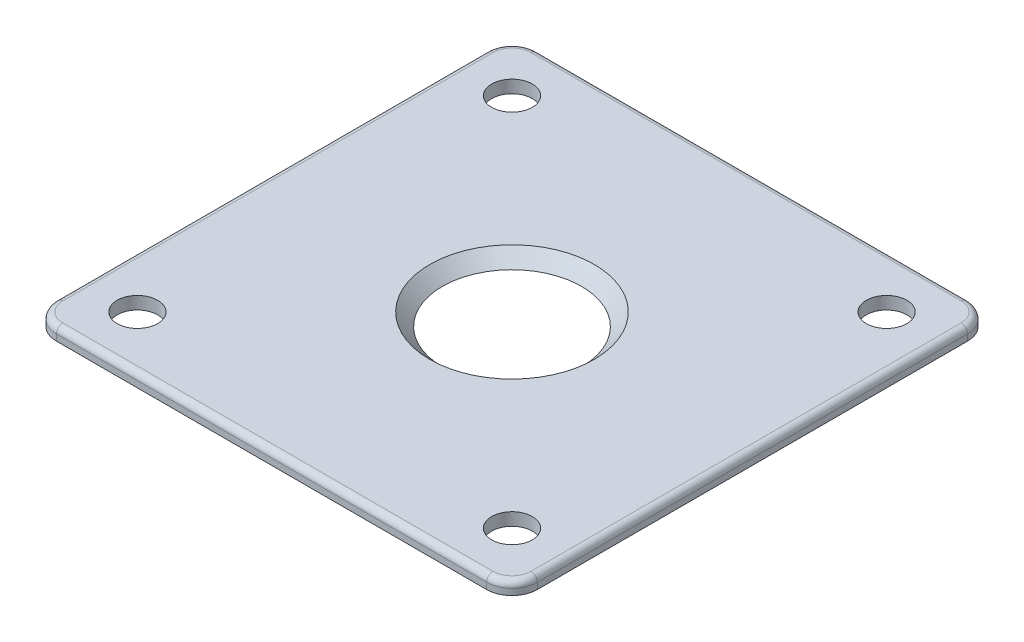
ISO-10303-21;
HEADER;
FILE_DESCRIPTION(('STEP AP214'),'2;1');
FILE_NAME('part.step','',(''),(''),'','','');
FILE_SCHEMA(('AUTOMOTIVE_DESIGN { 1 0 10303 214 1 1 1 1 }'));
ENDSEC;
DATA;
#1=APPLICATION_CONTEXT('core data for automotive mechanical design processes');
#2=APPLICATION_PROTOCOL_DEFINITION('international standard','automotive_design',2000,#1);
#3=PRODUCT_CONTEXT('',#1,'mechanical');
#4=PRODUCT('Part','Part','',(#3));
#5=PRODUCT_RELATED_PRODUCT_CATEGORY('part','',(#4));
#6=PRODUCT_DEFINITION_FORMATION('','',#4);
#7=PRODUCT_DEFINITION_CONTEXT('part definition',#1,'design');
#8=PRODUCT_DEFINITION('design','',#6,#7);
#9=PRODUCT_DEFINITION_SHAPE('','',#8);
#10=(LENGTH_UNIT() NAMED_UNIT(*) SI_UNIT(.MILLI.,.METRE.));
#11=(NAMED_UNIT(*) PLANE_ANGLE_UNIT() SI_UNIT($,.RADIAN.));
#12=(NAMED_UNIT(*) SI_UNIT($,.STERADIAN.) SOLID_ANGLE_UNIT());
#13=UNCERTAINTY_MEASURE_WITH_UNIT(LENGTH_MEASURE(1.E-05),#10,'distance_accuracy_value','');
#14=(GEOMETRIC_REPRESENTATION_CONTEXT(3) GLOBAL_UNCERTAINTY_ASSIGNED_CONTEXT((#13)) GLOBAL_UNIT_ASSIGNED_CONTEXT((#10,
#11,#12)) REPRESENTATION_CONTEXT('',''));
#15=CARTESIAN_POINT('',(0.,0.,0.));
#16=DIRECTION('',(0.,0.,1.));
#17=DIRECTION('',(1.,0.,0.));
#18=AXIS2_PLACEMENT_3D('',#15,#16,#17);
#19=CARTESIAN_POINT('',(17.,89.5,-17.));
#20=DIRECTION('',(0.,1.,0.));
#21=DIRECTION('',(0.,0.,1.));
#22=AXIS2_PLACEMENT_3D('',#19,#20,#21);
#23=PLANE('',#22);
#24=CARTESIAN_POINT('',(0.,89.5,0.));
#25=DIRECTION('',(0.,1.,0.));
#26=DIRECTION('',(0.,0.,1.));
#27=AXIS2_PLACEMENT_3D('',#24,#25,#26);
#28=CIRCLE('',#27,6.49999999999998);
#29=CARTESIAN_POINT('',(0.,89.5,6.49999999999998));
#30=VERTEX_POINT('',#29);
#31=EDGE_CURVE('E11',#30,#30,#28,.F.);
#32=ORIENTED_EDGE('',*,*,#31,.T.);
#33=EDGE_LOOP('',(#32));
#34=FACE_BOUND('',#33,.T.);
#35=DIRECTION('',(1.,0.,0.));
#36=VECTOR('',#35,1.);
#37=CARTESIAN_POINT('',(17.,89.5,18.5));
#38=LINE('',#37,#36);
#39=CARTESIAN_POINT('',(-17.,89.5,18.5));
#40=VERTEX_POINT('',#39);
#41=CARTESIAN_POINT('',(17.,89.5,18.5));
#42=VERTEX_POINT('',#41);
#43=EDGE_CURVE('E200',#40,#42,#38,.T.);
#44=ORIENTED_EDGE('',*,*,#43,.T.);
#45=CARTESIAN_POINT('',(17.,89.5,17.));
#46=DIRECTION('',(0.,1.,0.));
#47=DIRECTION('',(0.,0.,1.));
#48=AXIS2_PLACEMENT_3D('',#45,#46,#47);
#49=CIRCLE('',#48,1.5);
#50=CARTESIAN_POINT('',(18.5,89.5,17.));
#51=VERTEX_POINT('',#50);
#52=EDGE_CURVE('E202',#42,#51,#49,.T.);
#53=ORIENTED_EDGE('',*,*,#52,.T.);
#54=DIRECTION('',(0.,0.,-1.));
#55=VECTOR('',#54,1.);
#56=CARTESIAN_POINT('',(18.5,89.5,-17.));
#57=LINE('',#56,#55);
#58=CARTESIAN_POINT('',(18.5,89.5,-17.));
#59=VERTEX_POINT('',#58);
#60=EDGE_CURVE('E139',#51,#59,#57,.T.);
#61=ORIENTED_EDGE('',*,*,#60,.T.);
#62=CARTESIAN_POINT('',(17.,89.5,-17.));
#63=DIRECTION('',(0.,1.,0.));
#64=DIRECTION('',(0.,0.,1.));
#65=AXIS2_PLACEMENT_3D('',#62,#63,#64);
#66=CIRCLE('',#65,1.5);
#67=CARTESIAN_POINT('',(17.,89.5,-18.5));
#68=VERTEX_POINT('',#67);
#69=EDGE_CURVE('E190',#59,#68,#66,.T.);
#70=ORIENTED_EDGE('',*,*,#69,.T.);
#71=DIRECTION('',(-1.,0.,0.));
#72=VECTOR('',#71,1.);
#73=CARTESIAN_POINT('',(-17.,89.5,-18.5));
#74=LINE('',#73,#72);
#75=CARTESIAN_POINT('',(-17.,89.5,-18.5));
#76=VERTEX_POINT('',#75);
#77=EDGE_CURVE('E192',#68,#76,#74,.T.);
#78=ORIENTED_EDGE('',*,*,#77,.T.);
#79=CARTESIAN_POINT('',(-17.,89.5,-17.));
#80=DIRECTION('',(0.,1.,0.));
#81=DIRECTION('',(0.,0.,1.));
#82=AXIS2_PLACEMENT_3D('',#79,#80,#81);
#83=CIRCLE('',#82,1.5);
#84=CARTESIAN_POINT('',(-18.5,89.5,-17.));
#85=VERTEX_POINT('',#84);
#86=EDGE_CURVE('E194',#76,#85,#83,.T.);
#87=ORIENTED_EDGE('',*,*,#86,.T.);
#88=DIRECTION('',(0.,0.,1.));
#89=VECTOR('',#88,1.);
#90=CARTESIAN_POINT('',(-18.5,89.5,17.));
#91=LINE('',#90,#89);
#92=CARTESIAN_POINT('',(-18.5,89.5,17.));
#93=VERTEX_POINT('',#92);
#94=EDGE_CURVE('E196',#85,#93,#91,.T.);
#95=ORIENTED_EDGE('',*,*,#94,.T.);
#96=CARTESIAN_POINT('',(-17.,89.5,17.));
#97=DIRECTION('',(0.,1.,0.));
#98=DIRECTION('',(0.,0.,1.));
#99=AXIS2_PLACEMENT_3D('',#96,#97,#98);
#100=CIRCLE('',#99,1.5);
#101=EDGE_CURVE('E198',#93,#40,#100,.T.);
#102=ORIENTED_EDGE('',*,*,#101,.T.);
#103=EDGE_LOOP('',(#44,#53,#61,#70,#78,#87,#95,#102));
#104=FACE_BOUND('',#103,.T.);
#105=CARTESIAN_POINT('',(-14.8,89.5,-14.8));
#106=DIRECTION('',(0.,1.,0.));
#107=DIRECTION('',(0.,0.,1.));
#108=AXIS2_PLACEMENT_3D('',#105,#106,#107);
#109=CIRCLE('',#108,1.6);
#110=CARTESIAN_POINT('',(-14.8,89.5,-13.2));
#111=VERTEX_POINT('',#110);
#112=EDGE_CURVE('E253',#111,#111,#109,.T.);
#113=ORIENTED_EDGE('',*,*,#112,.F.);
#114=EDGE_LOOP('',(#113));
#115=FACE_BOUND('',#114,.T.);
#116=CARTESIAN_POINT('',(14.8,89.5,14.8));
#117=DIRECTION('',(0.,1.,0.));
#118=DIRECTION('',(0.,0.,1.));
#119=AXIS2_PLACEMENT_3D('',#116,#117,#118);
#120=CIRCLE('',#119,1.6);
#121=CARTESIAN_POINT('',(14.8,89.5,16.4));
#122=VERTEX_POINT('',#121);
#123=EDGE_CURVE('E158',#122,#122,#120,.T.);
#124=ORIENTED_EDGE('',*,*,#123,.F.);
#125=EDGE_LOOP('',(#124));
#126=FACE_BOUND('',#125,.T.);
#127=CARTESIAN_POINT('',(14.8,89.5,-14.8));
#128=DIRECTION('',(0.,1.,0.));
#129=DIRECTION('',(0.,0.,1.));
#130=AXIS2_PLACEMENT_3D('',#127,#128,#129);
#131=CIRCLE('',#130,1.6);
#132=CARTESIAN_POINT('',(14.8,89.5,-13.2));
#133=VERTEX_POINT('',#132);
#134=EDGE_CURVE('E259',#133,#133,#131,.T.);
#135=ORIENTED_EDGE('',*,*,#134,.F.);
#136=EDGE_LOOP('',(#135));
#137=FACE_BOUND('',#136,.T.);
#138=CARTESIAN_POINT('',(-14.8,89.5,14.8));
#139=DIRECTION('',(0.,1.,0.));
#140=DIRECTION('',(0.,0.,1.));
#141=AXIS2_PLACEMENT_3D('',#138,#139,#140);
#142=CIRCLE('',#141,1.6);
#143=CARTESIAN_POINT('',(-14.8,89.5,16.4));
#144=VERTEX_POINT('',#143);
#145=EDGE_CURVE('E245',#144,#144,#142,.T.);
#146=ORIENTED_EDGE('',*,*,#145,.F.);
#147=EDGE_LOOP('',(#146));
#148=FACE_BOUND('',#147,.T.);
#149=ADVANCED_FACE('F43',(#34,#104,#115,#126,#137,#148),#23,.T.);
#150=CARTESIAN_POINT('',(17.,88.5,-17.));
#151=DIRECTION('',(0.,1.,0.));
#152=DIRECTION('',(0.,0.,1.));
#153=AXIS2_PLACEMENT_3D('',#150,#151,#152);
#154=PLANE('',#153);
#155=CARTESIAN_POINT('',(17.,88.5,-17.));
#156=DIRECTION('',(0.,1.,0.));
#157=DIRECTION('',(0.,0.,1.));
#158=AXIS2_PLACEMENT_3D('',#155,#156,#157);
#159=CIRCLE('',#158,2.);
#160=CARTESIAN_POINT('',(19.,88.5,-17.));
#161=VERTEX_POINT('',#160);
#162=CARTESIAN_POINT('',(17.,88.5,-19.));
#163=VERTEX_POINT('',#162);
#164=EDGE_CURVE('E147',#161,#163,#159,.T.);
#165=ORIENTED_EDGE('',*,*,#164,.F.);
#166=DIRECTION('',(0.,0.,-1.));
#167=VECTOR('',#166,1.);
#168=CARTESIAN_POINT('',(19.,88.5,-17.));
#169=LINE('',#168,#167);
#170=CARTESIAN_POINT('',(19.,88.5,17.));
#171=VERTEX_POINT('',#170);
#172=EDGE_CURVE('E175',#171,#161,#169,.T.);
#173=ORIENTED_EDGE('',*,*,#172,.F.);
#174=CARTESIAN_POINT('',(17.,88.5,17.));
#175=DIRECTION('',(0.,1.,0.));
#176=DIRECTION('',(0.,0.,1.));
#177=AXIS2_PLACEMENT_3D('',#174,#175,#176);
#178=CIRCLE('',#177,2.);
#179=CARTESIAN_POINT('',(17.,88.5,19.));
#180=VERTEX_POINT('',#179);
#181=EDGE_CURVE('E172',#180,#171,#178,.T.);
#182=ORIENTED_EDGE('',*,*,#181,.F.);
#183=DIRECTION('',(1.,0.,0.));
#184=VECTOR('',#183,1.);
#185=CARTESIAN_POINT('',(-17.,88.5,19.));
#186=LINE('',#185,#184);
#187=CARTESIAN_POINT('',(-17.,88.5,19.));
#188=VERTEX_POINT('',#187);
#189=EDGE_CURVE('E169',#188,#180,#186,.T.);
#190=ORIENTED_EDGE('',*,*,#189,.F.);
#191=CARTESIAN_POINT('',(-17.,88.5,17.));
#192=DIRECTION('',(0.,1.,0.));
#193=DIRECTION('',(0.,0.,1.));
#194=AXIS2_PLACEMENT_3D('',#191,#192,#193);
#195=CIRCLE('',#194,2.);
#196=CARTESIAN_POINT('',(-19.,88.5,17.));
#197=VERTEX_POINT('',#196);
#198=EDGE_CURVE('E166',#197,#188,#195,.T.);
#199=ORIENTED_EDGE('',*,*,#198,.F.);
#200=DIRECTION('',(0.,0.,1.));
#201=VECTOR('',#200,1.);
#202=CARTESIAN_POINT('',(-19.,88.5,17.));
#203=LINE('',#202,#201);
#204=CARTESIAN_POINT('',(-19.,88.5,-17.));
#205=VERTEX_POINT('',#204);
#206=EDGE_CURVE('E163',#205,#197,#203,.T.);
#207=ORIENTED_EDGE('',*,*,#206,.F.);
#208=CARTESIAN_POINT('',(-17.,88.5,-17.));
#209=DIRECTION('',(0.,1.,0.));
#210=DIRECTION('',(0.,0.,1.));
#211=AXIS2_PLACEMENT_3D('',#208,#209,#210);
#212=CIRCLE('',#211,2.);
#213=CARTESIAN_POINT('',(-17.,88.5,-19.));
#214=VERTEX_POINT('',#213);
#215=EDGE_CURVE('E150',#214,#205,#212,.T.);
#216=ORIENTED_EDGE('',*,*,#215,.F.);
#217=DIRECTION('',(-1.,0.,0.));
#218=VECTOR('',#217,1.);
#219=CARTESIAN_POINT('',(17.,88.5,-19.));
#220=LINE('',#219,#218);
#221=EDGE_CURVE('E135',#163,#214,#220,.T.);
#222=ORIENTED_EDGE('',*,*,#221,.F.);
#223=EDGE_LOOP('',(#165,#173,#182,#190,#199,#207,#216,#222));
#224=FACE_BOUND('',#223,.T.);
#225=CARTESIAN_POINT('',(0.,88.5,0.));
#226=DIRECTION('',(0.,1.,0.));
#227=DIRECTION('',(0.,0.,1.));
#228=AXIS2_PLACEMENT_3D('',#225,#226,#227);
#229=CIRCLE('',#228,5.5);
#230=CARTESIAN_POINT('',(0.,88.5,5.5));
#231=VERTEX_POINT('',#230);
#232=EDGE_CURVE('E155',#231,#231,#229,.T.);
#233=ORIENTED_EDGE('',*,*,#232,.T.);
#234=EDGE_LOOP('',(#233));
#235=FACE_BOUND('',#234,.T.);
#236=CARTESIAN_POINT('',(14.8,88.5,14.8));
#237=DIRECTION('',(0.,1.,0.));
#238=DIRECTION('',(0.,0.,1.));
#239=AXIS2_PLACEMENT_3D('',#236,#237,#238);
#240=CIRCLE('',#239,1.6);
#241=CARTESIAN_POINT('',(14.8,88.5,16.4));
#242=VERTEX_POINT('',#241);
#243=EDGE_CURVE('E262',#242,#242,#240,.T.);
#244=ORIENTED_EDGE('',*,*,#243,.T.);
#245=EDGE_LOOP('',(#244));
#246=FACE_BOUND('',#245,.T.);
#247=CARTESIAN_POINT('',(14.8,88.5,-14.8));
#248=DIRECTION('',(0.,1.,0.));
#249=DIRECTION('',(0.,0.,1.));
#250=AXIS2_PLACEMENT_3D('',#247,#248,#249);
#251=CIRCLE('',#250,1.6);
#252=CARTESIAN_POINT('',(14.8,88.5,-13.2));
#253=VERTEX_POINT('',#252);
#254=EDGE_CURVE('E256',#253,#253,#251,.T.);
#255=ORIENTED_EDGE('',*,*,#254,.T.);
#256=EDGE_LOOP('',(#255));
#257=FACE_BOUND('',#256,.T.);
#258=CARTESIAN_POINT('',(-14.8,88.5,-14.8));
#259=DIRECTION('',(0.,1.,0.));
#260=DIRECTION('',(0.,0.,1.));
#261=AXIS2_PLACEMENT_3D('',#258,#259,#260);
#262=CIRCLE('',#261,1.6);
#263=CARTESIAN_POINT('',(-14.8,88.5,-13.2));
#264=VERTEX_POINT('',#263);
#265=EDGE_CURVE('E250',#264,#264,#262,.T.);
#266=ORIENTED_EDGE('',*,*,#265,.T.);
#267=EDGE_LOOP('',(#266));
#268=FACE_BOUND('',#267,.T.);
#269=CARTESIAN_POINT('',(-14.8,88.5,14.8));
#270=DIRECTION('',(0.,1.,0.));
#271=DIRECTION('',(0.,0.,1.));
#272=AXIS2_PLACEMENT_3D('',#269,#270,#271);
#273=CIRCLE('',#272,1.6);
#274=CARTESIAN_POINT('',(-14.8,88.5,16.4));
#275=VERTEX_POINT('',#274);
#276=EDGE_CURVE('E239',#275,#275,#273,.T.);
#277=ORIENTED_EDGE('',*,*,#276,.T.);
#278=EDGE_LOOP('',(#277));
#279=FACE_BOUND('',#278,.T.);
#280=ADVANCED_FACE('F144',(#224,#235,#246,#257,#268,#279),#154,.F.);
#281=CARTESIAN_POINT('',(17.,89.5,-17.));
#282=DIRECTION('',(0.,-1.,0.));
#283=DIRECTION('',(0.,0.,-1.));
#284=AXIS2_PLACEMENT_3D('',#281,#282,#283);
#285=CYLINDRICAL_SURFACE('',#284,2.);
#286=DIRECTION('',(0.,-1.,0.));
#287=VECTOR('',#286,1.);
#288=CARTESIAN_POINT('',(17.,89.5,-19.));
#289=LINE('',#288,#287);
#290=CARTESIAN_POINT('',(17.,89.,-19.));
#291=VERTEX_POINT('',#290);
#292=EDGE_CURVE('E132',#291,#163,#289,.T.);
#293=ORIENTED_EDGE('',*,*,#292,.F.);
#294=CARTESIAN_POINT('',(17.,89.,-17.));
#295=DIRECTION('',(0.,1.,0.));
#296=DIRECTION('',(0.,0.,1.));
#297=AXIS2_PLACEMENT_3D('',#294,#295,#296);
#298=CIRCLE('',#297,2.);
#299=CARTESIAN_POINT('',(19.,89.,-17.));
#300=VERTEX_POINT('',#299);
#301=EDGE_CURVE('E59',#291,#300,#298,.F.);
#302=ORIENTED_EDGE('',*,*,#301,.T.);
#303=DIRECTION('',(0.,-1.,0.));
#304=VECTOR('',#303,1.);
#305=CARTESIAN_POINT('',(19.,89.5,-17.));
#306=LINE('',#305,#304);
#307=EDGE_CURVE('E153',#300,#161,#306,.T.);
#308=ORIENTED_EDGE('',*,*,#307,.T.);
#309=ORIENTED_EDGE('',*,*,#164,.T.);
#310=EDGE_LOOP('',(#293,#302,#308,#309));
#311=FACE_BOUND('',#310,.T.);
#312=ADVANCED_FACE('F152',(#311),#285,.T.);
#313=CARTESIAN_POINT('',(17.,89.5,-19.));
#314=DIRECTION('',(0.,0.,1.));
#315=DIRECTION('',(1.,0.,0.));
#316=AXIS2_PLACEMENT_3D('',#313,#314,#315);
#317=PLANE('',#316);
#318=DIRECTION('',(0.,-1.,0.));
#319=VECTOR('',#318,1.);
#320=CARTESIAN_POINT('',(-17.,89.5,-19.));
#321=LINE('',#320,#319);
#322=CARTESIAN_POINT('',(-17.,89.,-19.));
#323=VERTEX_POINT('',#322);
#324=EDGE_CURVE('E140',#323,#214,#321,.T.);
#325=ORIENTED_EDGE('',*,*,#324,.F.);
#326=DIRECTION('',(-1.,0.,0.));
#327=VECTOR('',#326,1.);
#328=CARTESIAN_POINT('',(17.,89.,-19.));
#329=LINE('',#328,#327);
#330=EDGE_CURVE('E67',#323,#291,#329,.F.);
#331=ORIENTED_EDGE('',*,*,#330,.T.);
#332=ORIENTED_EDGE('',*,*,#292,.T.);
#333=ORIENTED_EDGE('',*,*,#221,.T.);
#334=EDGE_LOOP('',(#325,#331,#332,#333));
#335=FACE_BOUND('',#334,.T.);
#336=ADVANCED_FACE('F134',(#335),#317,.F.);
#337=CARTESIAN_POINT('',(-17.,89.5,-17.));
#338=DIRECTION('',(0.,-1.,0.));
#339=DIRECTION('',(0.,0.,-1.));
#340=AXIS2_PLACEMENT_3D('',#337,#338,#339);
#341=CYLINDRICAL_SURFACE('',#340,2.);
#342=DIRECTION('',(0.,-1.,0.));
#343=VECTOR('',#342,1.);
#344=CARTESIAN_POINT('',(-19.,89.5,-17.));
#345=LINE('',#344,#343);
#346=CARTESIAN_POINT('',(-19.,89.,-17.));
#347=VERTEX_POINT('',#346);
#348=EDGE_CURVE('E186',#347,#205,#345,.T.);
#349=ORIENTED_EDGE('',*,*,#348,.F.);
#350=CARTESIAN_POINT('',(-17.,89.,-17.));
#351=DIRECTION('',(0.,1.,0.));
#352=DIRECTION('',(0.,0.,1.));
#353=AXIS2_PLACEMENT_3D('',#350,#351,#352);
#354=CIRCLE('',#353,2.);
#355=EDGE_CURVE('E214',#347,#323,#354,.F.);
#356=ORIENTED_EDGE('',*,*,#355,.T.);
#357=ORIENTED_EDGE('',*,*,#324,.T.);
#358=ORIENTED_EDGE('',*,*,#215,.T.);
#359=EDGE_LOOP('',(#349,#356,#357,#358));
#360=FACE_BOUND('',#359,.T.);
#361=ADVANCED_FACE('F312',(#360),#341,.T.);
#362=CARTESIAN_POINT('',(-19.,89.5,17.));
#363=DIRECTION('',(1.,0.,0.));
#364=DIRECTION('',(0.,0.,-1.));
#365=AXIS2_PLACEMENT_3D('',#362,#363,#364);
#366=PLANE('',#365);
#367=DIRECTION('',(0.,-1.,0.));
#368=VECTOR('',#367,1.);
#369=CARTESIAN_POINT('',(-19.,89.5,17.));
#370=LINE('',#369,#368);
#371=CARTESIAN_POINT('',(-19.,89.,17.));
#372=VERTEX_POINT('',#371);
#373=EDGE_CURVE('E184',#372,#197,#370,.T.);
#374=ORIENTED_EDGE('',*,*,#373,.F.);
#375=DIRECTION('',(0.,0.,1.));
#376=VECTOR('',#375,1.);
#377=CARTESIAN_POINT('',(-19.,89.,-17.));
#378=LINE('',#377,#376);
#379=EDGE_CURVE('E212',#372,#347,#378,.F.);
#380=ORIENTED_EDGE('',*,*,#379,.T.);
#381=ORIENTED_EDGE('',*,*,#348,.T.);
#382=ORIENTED_EDGE('',*,*,#206,.T.);
#383=EDGE_LOOP('',(#374,#380,#381,#382));
#384=FACE_BOUND('',#383,.T.);
#385=ADVANCED_FACE('F308',(#384),#366,.F.);
#386=CARTESIAN_POINT('',(-17.,89.5,17.));
#387=DIRECTION('',(0.,-1.,0.));
#388=DIRECTION('',(0.,0.,-1.));
#389=AXIS2_PLACEMENT_3D('',#386,#387,#388);
#390=CYLINDRICAL_SURFACE('',#389,2.);
#391=DIRECTION('',(0.,-1.,0.));
#392=VECTOR('',#391,1.);
#393=CARTESIAN_POINT('',(-17.,89.5,19.));
#394=LINE('',#393,#392);
#395=CARTESIAN_POINT('',(-17.,89.,19.));
#396=VERTEX_POINT('',#395);
#397=EDGE_CURVE('E182',#396,#188,#394,.T.);
#398=ORIENTED_EDGE('',*,*,#397,.F.);
#399=CARTESIAN_POINT('',(-17.,89.,17.));
#400=DIRECTION('',(0.,1.,0.));
#401=DIRECTION('',(0.,0.,1.));
#402=AXIS2_PLACEMENT_3D('',#399,#400,#401);
#403=CIRCLE('',#402,2.);
#404=EDGE_CURVE('E210',#396,#372,#403,.F.);
#405=ORIENTED_EDGE('',*,*,#404,.T.);
#406=ORIENTED_EDGE('',*,*,#373,.T.);
#407=ORIENTED_EDGE('',*,*,#198,.T.);
#408=EDGE_LOOP('',(#398,#405,#406,#407));
#409=FACE_BOUND('',#408,.T.);
#410=ADVANCED_FACE('F304',(#409),#390,.T.);
#411=CARTESIAN_POINT('',(-17.,89.5,19.));
#412=DIRECTION('',(0.,0.,-1.));
#413=DIRECTION('',(-1.,0.,0.));
#414=AXIS2_PLACEMENT_3D('',#411,#412,#413);
#415=PLANE('',#414);
#416=DIRECTION('',(0.,-1.,0.));
#417=VECTOR('',#416,1.);
#418=CARTESIAN_POINT('',(17.,89.5,19.));
#419=LINE('',#418,#417);
#420=CARTESIAN_POINT('',(17.,89.,19.));
#421=VERTEX_POINT('',#420);
#422=EDGE_CURVE('E180',#421,#180,#419,.T.);
#423=ORIENTED_EDGE('',*,*,#422,.F.);
#424=DIRECTION('',(1.,0.,0.));
#425=VECTOR('',#424,1.);
#426=CARTESIAN_POINT('',(-17.,89.,19.));
#427=LINE('',#426,#425);
#428=EDGE_CURVE('E208',#421,#396,#427,.F.);
#429=ORIENTED_EDGE('',*,*,#428,.T.);
#430=ORIENTED_EDGE('',*,*,#397,.T.);
#431=ORIENTED_EDGE('',*,*,#189,.T.);
#432=EDGE_LOOP('',(#423,#429,#430,#431));
#433=FACE_BOUND('',#432,.T.);
#434=ADVANCED_FACE('F300',(#433),#415,.F.);
#435=CARTESIAN_POINT('',(17.,89.5,17.));
#436=DIRECTION('',(0.,-1.,0.));
#437=DIRECTION('',(0.,0.,-1.));
#438=AXIS2_PLACEMENT_3D('',#435,#436,#437);
#439=CYLINDRICAL_SURFACE('',#438,2.);
#440=DIRECTION('',(0.,-1.,0.));
#441=VECTOR('',#440,1.);
#442=CARTESIAN_POINT('',(19.,89.5,17.));
#443=LINE('',#442,#441);
#444=CARTESIAN_POINT('',(19.,89.,17.));
#445=VERTEX_POINT('',#444);
#446=EDGE_CURVE('E178',#445,#171,#443,.T.);
#447=ORIENTED_EDGE('',*,*,#446,.F.);
#448=CARTESIAN_POINT('',(17.,89.,17.));
#449=DIRECTION('',(0.,1.,0.));
#450=DIRECTION('',(0.,0.,1.));
#451=AXIS2_PLACEMENT_3D('',#448,#449,#450);
#452=CIRCLE('',#451,2.);
#453=EDGE_CURVE('E205',#445,#421,#452,.F.);
#454=ORIENTED_EDGE('',*,*,#453,.T.);
#455=ORIENTED_EDGE('',*,*,#422,.T.);
#456=ORIENTED_EDGE('',*,*,#181,.T.);
#457=EDGE_LOOP('',(#447,#454,#455,#456));
#458=FACE_BOUND('',#457,.T.);
#459=ADVANCED_FACE('F285',(#458),#439,.T.);
#460=CARTESIAN_POINT('',(19.,89.5,-17.));
#461=DIRECTION('',(-1.,0.,0.));
#462=DIRECTION('',(0.,0.,1.));
#463=AXIS2_PLACEMENT_3D('',#460,#461,#462);
#464=PLANE('',#463);
#465=ORIENTED_EDGE('',*,*,#307,.F.);
#466=DIRECTION('',(0.,0.,-1.));
#467=VECTOR('',#466,1.);
#468=CARTESIAN_POINT('',(19.,89.,17.));
#469=LINE('',#468,#467);
#470=EDGE_CURVE('E52',#300,#445,#469,.F.);
#471=ORIENTED_EDGE('',*,*,#470,.T.);
#472=ORIENTED_EDGE('',*,*,#446,.T.);
#473=ORIENTED_EDGE('',*,*,#172,.T.);
#474=EDGE_LOOP('',(#465,#471,#472,#473));
#475=FACE_BOUND('',#474,.T.);
#476=ADVANCED_FACE('F274',(#475),#464,.F.);
#477=CARTESIAN_POINT('',(14.8,89.5,14.8));
#478=DIRECTION('',(0.,-1.,0.));
#479=DIRECTION('',(0.,0.,-1.));
#480=AXIS2_PLACEMENT_3D('',#477,#478,#479);
#481=CYLINDRICAL_SURFACE('',#480,1.6);
#482=ORIENTED_EDGE('',*,*,#123,.T.);
#483=EDGE_LOOP('',(#482));
#484=FACE_BOUND('',#483,.T.);
#485=ORIENTED_EDGE('',*,*,#243,.F.);
#486=EDGE_LOOP('',(#485));
#487=FACE_BOUND('',#486,.T.);
#488=ADVANCED_FACE('F271',(#484,#487),#481,.F.);
#489=CARTESIAN_POINT('',(14.8,89.5,-14.8));
#490=DIRECTION('',(0.,-1.,0.));
#491=DIRECTION('',(0.,0.,-1.));
#492=AXIS2_PLACEMENT_3D('',#489,#490,#491);
#493=CYLINDRICAL_SURFACE('',#492,1.6);
#494=ORIENTED_EDGE('',*,*,#134,.T.);
#495=EDGE_LOOP('',(#494));
#496=FACE_BOUND('',#495,.T.);
#497=ORIENTED_EDGE('',*,*,#254,.F.);
#498=EDGE_LOOP('',(#497));
#499=FACE_BOUND('',#498,.T.);
#500=ADVANCED_FACE('F273',(#496,#499),#493,.F.);
#501=CARTESIAN_POINT('',(-14.8,89.5,-14.8));
#502=DIRECTION('',(0.,-1.,0.));
#503=DIRECTION('',(0.,0.,-1.));
#504=AXIS2_PLACEMENT_3D('',#501,#502,#503);
#505=CYLINDRICAL_SURFACE('',#504,1.6);
#506=ORIENTED_EDGE('',*,*,#112,.T.);
#507=EDGE_LOOP('',(#506));
#508=FACE_BOUND('',#507,.T.);
#509=ORIENTED_EDGE('',*,*,#265,.F.);
#510=EDGE_LOOP('',(#509));
#511=FACE_BOUND('',#510,.T.);
#512=ADVANCED_FACE('F282',(#508,#511),#505,.F.);
#513=CARTESIAN_POINT('',(-14.8,89.5,14.8));
#514=DIRECTION('',(0.,-1.,0.));
#515=DIRECTION('',(0.,0.,-1.));
#516=AXIS2_PLACEMENT_3D('',#513,#514,#515);
#517=CYLINDRICAL_SURFACE('',#516,1.6);
#518=ORIENTED_EDGE('',*,*,#145,.T.);
#519=EDGE_LOOP('',(#518));
#520=FACE_BOUND('',#519,.T.);
#521=ORIENTED_EDGE('',*,*,#276,.F.);
#522=EDGE_LOOP('',(#521));
#523=FACE_BOUND('',#522,.T.);
#524=ADVANCED_FACE('F349',(#520,#523),#517,.F.);
#525=CARTESIAN_POINT('',(-17.,89.,-17.));
#526=DIRECTION('',(0.,1.,0.));
#527=DIRECTION('',(0.,0.,1.));
#528=AXIS2_PLACEMENT_3D('',#525,#526,#527);
#529=TOROIDAL_SURFACE('',#528,1.5,0.5);
#530=CARTESIAN_POINT('',(-17.,89.,-18.5));
#531=DIRECTION('',(1.,0.,0.));
#532=DIRECTION('',(0.,0.,-1.));
#533=AXIS2_PLACEMENT_3D('',#530,#531,#532);
#534=CIRCLE('',#533,0.5);
#535=EDGE_CURVE('E235',#323,#76,#534,.T.);
#536=ORIENTED_EDGE('',*,*,#535,.F.);
#537=ORIENTED_EDGE('',*,*,#355,.F.);
#538=CARTESIAN_POINT('',(-18.5,89.,-17.));
#539=DIRECTION('',(0.,0.,1.));
#540=DIRECTION('',(1.,0.,0.));
#541=AXIS2_PLACEMENT_3D('',#538,#539,#540);
#542=CIRCLE('',#541,0.5);
#543=EDGE_CURVE('E237',#85,#347,#542,.T.);
#544=ORIENTED_EDGE('',*,*,#543,.F.);
#545=ORIENTED_EDGE('',*,*,#86,.F.);
#546=EDGE_LOOP('',(#536,#537,#544,#545));
#547=FACE_BOUND('',#546,.T.);
#548=ADVANCED_FACE('F347',(#547),#529,.T.);
#549=CARTESIAN_POINT('',(-18.5,89.,-17.));
#550=DIRECTION('',(0.,0.,-1.));
#551=DIRECTION('',(-1.,0.,0.));
#552=AXIS2_PLACEMENT_3D('',#549,#550,#551);
#553=CYLINDRICAL_SURFACE('',#552,0.5);
#554=ORIENTED_EDGE('',*,*,#543,.T.);
#555=ORIENTED_EDGE('',*,*,#379,.F.);
#556=CARTESIAN_POINT('',(-18.5,89.,17.));
#557=DIRECTION('',(0.,0.,1.));
#558=DIRECTION('',(1.,0.,0.));
#559=AXIS2_PLACEMENT_3D('',#556,#557,#558);
#560=CIRCLE('',#559,0.5);
#561=EDGE_CURVE('E232',#93,#372,#560,.T.);
#562=ORIENTED_EDGE('',*,*,#561,.F.);
#563=ORIENTED_EDGE('',*,*,#94,.F.);
#564=EDGE_LOOP('',(#554,#555,#562,#563));
#565=FACE_BOUND('',#564,.T.);
#566=ADVANCED_FACE('F344',(#565),#553,.T.);
#567=CARTESIAN_POINT('',(17.,89.,-18.5));
#568=DIRECTION('',(1.,0.,0.));
#569=DIRECTION('',(0.,0.,-1.));
#570=AXIS2_PLACEMENT_3D('',#567,#568,#569);
#571=CYLINDRICAL_SURFACE('',#570,0.5);
#572=ORIENTED_EDGE('',*,*,#535,.T.);
#573=ORIENTED_EDGE('',*,*,#77,.F.);
#574=CARTESIAN_POINT('',(17.,89.,-18.5));
#575=DIRECTION('',(1.,0.,0.));
#576=DIRECTION('',(0.,0.,-1.));
#577=AXIS2_PLACEMENT_3D('',#574,#575,#576);
#578=CIRCLE('',#577,0.5);
#579=EDGE_CURVE('E229',#291,#68,#578,.T.);
#580=ORIENTED_EDGE('',*,*,#579,.F.);
#581=ORIENTED_EDGE('',*,*,#330,.F.);
#582=EDGE_LOOP('',(#572,#573,#580,#581));
#583=FACE_BOUND('',#582,.T.);
#584=ADVANCED_FACE('F340',(#583),#571,.T.);
#585=CARTESIAN_POINT('',(-17.,89.,17.));
#586=DIRECTION('',(0.,1.,0.));
#587=DIRECTION('',(0.,0.,1.));
#588=AXIS2_PLACEMENT_3D('',#585,#586,#587);
#589=TOROIDAL_SURFACE('',#588,1.5,0.5);
#590=ORIENTED_EDGE('',*,*,#561,.T.);
#591=ORIENTED_EDGE('',*,*,#404,.F.);
#592=CARTESIAN_POINT('',(-17.,89.,18.5));
#593=DIRECTION('',(1.,0.,0.));
#594=DIRECTION('',(0.,0.,-1.));
#595=AXIS2_PLACEMENT_3D('',#592,#593,#594);
#596=CIRCLE('',#595,0.5);
#597=EDGE_CURVE('E226',#40,#396,#596,.T.);
#598=ORIENTED_EDGE('',*,*,#597,.F.);
#599=ORIENTED_EDGE('',*,*,#101,.F.);
#600=EDGE_LOOP('',(#590,#591,#598,#599));
#601=FACE_BOUND('',#600,.T.);
#602=ADVANCED_FACE('F336',(#601),#589,.T.);
#603=CARTESIAN_POINT('',(17.,89.,-17.));
#604=DIRECTION('',(0.,1.,0.));
#605=DIRECTION('',(0.,0.,1.));
#606=AXIS2_PLACEMENT_3D('',#603,#604,#605);
#607=TOROIDAL_SURFACE('',#606,1.5,0.5);
#608=ORIENTED_EDGE('',*,*,#579,.T.);
#609=ORIENTED_EDGE('',*,*,#69,.F.);
#610=CARTESIAN_POINT('',(18.5,89.,-17.));
#611=DIRECTION('',(0.,0.,1.));
#612=DIRECTION('',(1.,0.,0.));
#613=AXIS2_PLACEMENT_3D('',#610,#611,#612);
#614=CIRCLE('',#613,0.5);
#615=EDGE_CURVE('E223',#300,#59,#614,.T.);
#616=ORIENTED_EDGE('',*,*,#615,.F.);
#617=ORIENTED_EDGE('',*,*,#301,.F.);
#618=EDGE_LOOP('',(#608,#609,#616,#617));
#619=FACE_BOUND('',#618,.T.);
#620=ADVANCED_FACE('F332',(#619),#607,.T.);
#621=CARTESIAN_POINT('',(17.,89.,18.5));
#622=DIRECTION('',(-1.,0.,0.));
#623=DIRECTION('',(0.,0.,1.));
#624=AXIS2_PLACEMENT_3D('',#621,#622,#623);
#625=CYLINDRICAL_SURFACE('',#624,0.5);
#626=ORIENTED_EDGE('',*,*,#597,.T.);
#627=ORIENTED_EDGE('',*,*,#428,.F.);
#628=CARTESIAN_POINT('',(17.,89.,18.5));
#629=DIRECTION('',(1.,0.,0.));
#630=DIRECTION('',(0.,0.,-1.));
#631=AXIS2_PLACEMENT_3D('',#628,#629,#630);
#632=CIRCLE('',#631,0.5);
#633=EDGE_CURVE('E221',#42,#421,#632,.T.);
#634=ORIENTED_EDGE('',*,*,#633,.F.);
#635=ORIENTED_EDGE('',*,*,#43,.F.);
#636=EDGE_LOOP('',(#626,#627,#634,#635));
#637=FACE_BOUND('',#636,.T.);
#638=ADVANCED_FACE('F328',(#637),#625,.T.);
#639=CARTESIAN_POINT('',(18.5,89.,-17.));
#640=DIRECTION('',(0.,0.,1.));
#641=DIRECTION('',(1.,0.,0.));
#642=AXIS2_PLACEMENT_3D('',#639,#640,#641);
#643=CYLINDRICAL_SURFACE('',#642,0.5);
#644=ORIENTED_EDGE('',*,*,#615,.T.);
#645=ORIENTED_EDGE('',*,*,#60,.F.);
#646=CARTESIAN_POINT('',(18.5,89.,17.));
#647=DIRECTION('',(0.,0.,1.));
#648=DIRECTION('',(0.,-1.,0.));
#649=AXIS2_PLACEMENT_3D('',#646,#647,#648);
#650=CIRCLE('',#649,0.5);
#651=EDGE_CURVE('E219',#445,#51,#650,.T.);
#652=ORIENTED_EDGE('',*,*,#651,.F.);
#653=ORIENTED_EDGE('',*,*,#470,.F.);
#654=EDGE_LOOP('',(#644,#645,#652,#653));
#655=FACE_BOUND('',#654,.T.);
#656=ADVANCED_FACE('F324',(#655),#643,.T.);
#657=CARTESIAN_POINT('',(17.,89.,17.));
#658=DIRECTION('',(0.,1.,0.));
#659=DIRECTION('',(0.,0.,1.));
#660=AXIS2_PLACEMENT_3D('',#657,#658,#659);
#661=TOROIDAL_SURFACE('',#660,1.5,0.5);
#662=ORIENTED_EDGE('',*,*,#633,.T.);
#663=ORIENTED_EDGE('',*,*,#453,.F.);
#664=ORIENTED_EDGE('',*,*,#651,.T.);
#665=ORIENTED_EDGE('',*,*,#52,.F.);
#666=EDGE_LOOP('',(#662,#663,#664,#665));
#667=FACE_BOUND('',#666,.T.);
#668=ADVANCED_FACE('F321',(#667),#661,.T.);
#669=CARTESIAN_POINT('',(0.,88.5,0.));
#670=DIRECTION('',(0.,1.,0.));
#671=DIRECTION('',(0.,0.,1.));
#672=AXIS2_PLACEMENT_3D('',#669,#670,#671);
#673=CONICAL_SURFACE('',#672,5.5,0.785398163397447);
#674=ORIENTED_EDGE('',*,*,#31,.F.);
#675=EDGE_LOOP('',(#674));
#676=FACE_BOUND('',#675,.T.);
#677=ORIENTED_EDGE('',*,*,#232,.F.);
#678=EDGE_LOOP('',(#677));
#679=FACE_BOUND('',#678,.T.);
#680=ADVANCED_FACE('F46',(#676,#679),#673,.F.);
#681=CLOSED_SHELL('',(#149,#280,#312,#336,#361,#385,#410,#434,#459,#476,#488,#500,#512,#524,
#548,#566,#584,#602,#620,#638,#656,#668,#680));
#682=MANIFOLD_SOLID_BREP('B2',#681);
#683=ADVANCED_BREP_SHAPE_REPRESENTATION('',(#18,#682),#14);
#684=SHAPE_DEFINITION_REPRESENTATION(#9,#683);
ENDSEC;
END-ISO-10303-21;
